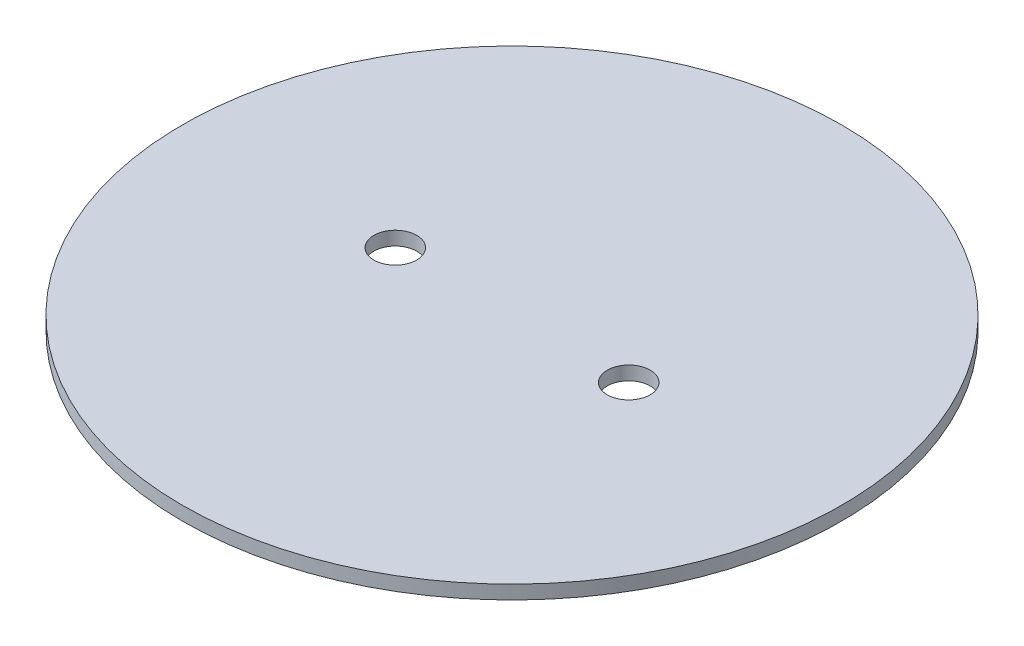
ISO-10303-21;
HEADER;
FILE_DESCRIPTION(('STEP AP214'),'2;1');
FILE_NAME('part.step','',(''),(''),'','','');
FILE_SCHEMA(('AUTOMOTIVE_DESIGN { 1 0 10303 214 1 1 1 1 }'));
ENDSEC;
DATA;
#1=APPLICATION_CONTEXT('core data for automotive mechanical design processes');
#2=APPLICATION_PROTOCOL_DEFINITION('international standard','automotive_design',2000,#1);
#3=PRODUCT_CONTEXT('',#1,'mechanical');
#4=PRODUCT('Part','Part','',(#3));
#5=PRODUCT_RELATED_PRODUCT_CATEGORY('part','',(#4));
#6=PRODUCT_DEFINITION_FORMATION('','',#4);
#7=PRODUCT_DEFINITION_CONTEXT('part definition',#1,'design');
#8=PRODUCT_DEFINITION('design','',#6,#7);
#9=PRODUCT_DEFINITION_SHAPE('','',#8);
#10=(LENGTH_UNIT() NAMED_UNIT(*) SI_UNIT(.MILLI.,.METRE.));
#11=(NAMED_UNIT(*) PLANE_ANGLE_UNIT() SI_UNIT($,.RADIAN.));
#12=(NAMED_UNIT(*) SI_UNIT($,.STERADIAN.) SOLID_ANGLE_UNIT());
#13=UNCERTAINTY_MEASURE_WITH_UNIT(LENGTH_MEASURE(1.E-05),#10,'distance_accuracy_value','');
#14=(GEOMETRIC_REPRESENTATION_CONTEXT(3) GLOBAL_UNCERTAINTY_ASSIGNED_CONTEXT((#13)) GLOBAL_UNIT_ASSIGNED_CONTEXT((#10,
#11,#12)) REPRESENTATION_CONTEXT('',''));
#15=CARTESIAN_POINT('',(0.,0.,0.));
#16=DIRECTION('',(0.,0.,1.));
#17=DIRECTION('',(1.,0.,0.));
#18=AXIS2_PLACEMENT_3D('',#15,#16,#17);
#19=CARTESIAN_POINT('',(0.,3.175,0.));
#20=DIRECTION('',(0.,1.,0.));
#21=DIRECTION('',(0.,0.,1.));
#22=AXIS2_PLACEMENT_3D('',#19,#20,#21);
#23=PLANE('',#22);
#24=CARTESIAN_POINT('',(26.9875,3.175,0.));
#25=DIRECTION('',(0.,1.,0.));
#26=DIRECTION('',(0.,0.,1.));
#27=AXIS2_PLACEMENT_3D('',#24,#25,#26);
#28=CIRCLE('',#27,4.953);
#29=CARTESIAN_POINT('',(26.9875,3.175,4.95299999999999));
#30=VERTEX_POINT('',#29);
#31=EDGE_CURVE('E46',#30,#30,#28,.T.);
#32=ORIENTED_EDGE('',*,*,#31,.F.);
#33=EDGE_LOOP('',(#32));
#34=FACE_BOUND('',#33,.T.);
#35=CARTESIAN_POINT('',(0.,3.175,0.));
#36=DIRECTION('',(0.,1.,0.));
#37=DIRECTION('',(0.,0.,1.));
#38=AXIS2_PLACEMENT_3D('',#35,#36,#37);
#39=CIRCLE('',#38,76.2);
#40=CARTESIAN_POINT('',(0.,3.175,76.2));
#41=VERTEX_POINT('',#40);
#42=EDGE_CURVE('E10',#41,#41,#39,.T.);
#43=ORIENTED_EDGE('',*,*,#42,.T.);
#44=EDGE_LOOP('',(#43));
#45=FACE_BOUND('',#44,.T.);
#46=CARTESIAN_POINT('',(-26.9875,3.175,0.));
#47=DIRECTION('',(0.,1.,0.));
#48=DIRECTION('',(0.,0.,1.));
#49=AXIS2_PLACEMENT_3D('',#46,#47,#48);
#50=CIRCLE('',#49,4.95299999999999);
#51=CARTESIAN_POINT('',(-26.9875,3.175,4.95299999999999));
#52=VERTEX_POINT('',#51);
#53=EDGE_CURVE('E51',#52,#52,#50,.T.);
#54=ORIENTED_EDGE('',*,*,#53,.F.);
#55=EDGE_LOOP('',(#54));
#56=FACE_BOUND('',#55,.T.);
#57=ADVANCED_FACE('F35',(#34,#45,#56),#23,.T.);
#58=CARTESIAN_POINT('',(0.,0.,0.));
#59=DIRECTION('',(0.,1.,0.));
#60=DIRECTION('',(0.,0.,1.));
#61=AXIS2_PLACEMENT_3D('',#58,#59,#60);
#62=PLANE('',#61);
#63=CARTESIAN_POINT('',(0.,0.,0.));
#64=DIRECTION('',(0.,1.,0.));
#65=DIRECTION('',(0.,0.,1.));
#66=AXIS2_PLACEMENT_3D('',#63,#64,#65);
#67=CIRCLE('',#66,76.2);
#68=CARTESIAN_POINT('',(0.,0.,76.2));
#69=VERTEX_POINT('',#68);
#70=EDGE_CURVE('E39',#69,#69,#67,.T.);
#71=ORIENTED_EDGE('',*,*,#70,.F.);
#72=EDGE_LOOP('',(#71));
#73=FACE_BOUND('',#72,.T.);
#74=CARTESIAN_POINT('',(26.9875,0.,0.));
#75=DIRECTION('',(0.,1.,0.));
#76=DIRECTION('',(0.,0.,1.));
#77=AXIS2_PLACEMENT_3D('',#74,#75,#76);
#78=CIRCLE('',#77,4.953);
#79=CARTESIAN_POINT('',(26.9875,0.,4.95299999999999));
#80=VERTEX_POINT('',#79);
#81=EDGE_CURVE('E48',#80,#80,#78,.T.);
#82=ORIENTED_EDGE('',*,*,#81,.T.);
#83=EDGE_LOOP('',(#82));
#84=FACE_BOUND('',#83,.T.);
#85=CARTESIAN_POINT('',(-26.9875,0.,0.));
#86=DIRECTION('',(0.,1.,0.));
#87=DIRECTION('',(0.,0.,1.));
#88=AXIS2_PLACEMENT_3D('',#85,#86,#87);
#89=CIRCLE('',#88,4.95299999999999);
#90=CARTESIAN_POINT('',(-26.9875,0.,4.95299999999999));
#91=VERTEX_POINT('',#90);
#92=EDGE_CURVE('E54',#91,#91,#89,.T.);
#93=ORIENTED_EDGE('',*,*,#92,.T.);
#94=EDGE_LOOP('',(#93));
#95=FACE_BOUND('',#94,.T.);
#96=ADVANCED_FACE('F64',(#73,#84,#95),#62,.F.);
#97=CARTESIAN_POINT('',(0.,3.175,0.));
#98=DIRECTION('',(0.,-1.,0.));
#99=DIRECTION('',(0.,0.,-1.));
#100=AXIS2_PLACEMENT_3D('',#97,#98,#99);
#101=CYLINDRICAL_SURFACE('',#100,76.2);
#102=ORIENTED_EDGE('',*,*,#42,.F.);
#103=EDGE_LOOP('',(#102));
#104=FACE_BOUND('',#103,.T.);
#105=ORIENTED_EDGE('',*,*,#70,.T.);
#106=EDGE_LOOP('',(#105));
#107=FACE_BOUND('',#106,.T.);
#108=ADVANCED_FACE('F37',(#104,#107),#101,.T.);
#109=CARTESIAN_POINT('',(26.9875,3.175,0.));
#110=DIRECTION('',(0.,-1.,0.));
#111=DIRECTION('',(0.,0.,-1.));
#112=AXIS2_PLACEMENT_3D('',#109,#110,#111);
#113=CYLINDRICAL_SURFACE('',#112,4.953);
#114=ORIENTED_EDGE('',*,*,#31,.T.);
#115=EDGE_LOOP('',(#114));
#116=FACE_BOUND('',#115,.T.);
#117=ORIENTED_EDGE('',*,*,#81,.F.);
#118=EDGE_LOOP('',(#117));
#119=FACE_BOUND('',#118,.T.);
#120=ADVANCED_FACE('F73',(#116,#119),#113,.F.);
#121=CARTESIAN_POINT('',(-26.9875,3.175,0.));
#122=DIRECTION('',(0.,-1.,0.));
#123=DIRECTION('',(0.,0.,-1.));
#124=AXIS2_PLACEMENT_3D('',#121,#122,#123);
#125=CYLINDRICAL_SURFACE('',#124,4.95299999999999);
#126=ORIENTED_EDGE('',*,*,#53,.T.);
#127=EDGE_LOOP('',(#126));
#128=FACE_BOUND('',#127,.T.);
#129=ORIENTED_EDGE('',*,*,#92,.F.);
#130=EDGE_LOOP('',(#129));
#131=FACE_BOUND('',#130,.T.);
#132=ADVANCED_FACE('F60',(#128,#131),#125,.F.);
#133=CLOSED_SHELL('',(#57,#96,#108,#120,#132));
#134=MANIFOLD_SOLID_BREP('B2',#133);
#135=ADVANCED_BREP_SHAPE_REPRESENTATION('',(#18,#134),#14);
#136=SHAPE_DEFINITION_REPRESENTATION(#9,#135);
ENDSEC;
END-ISO-10303-21;
